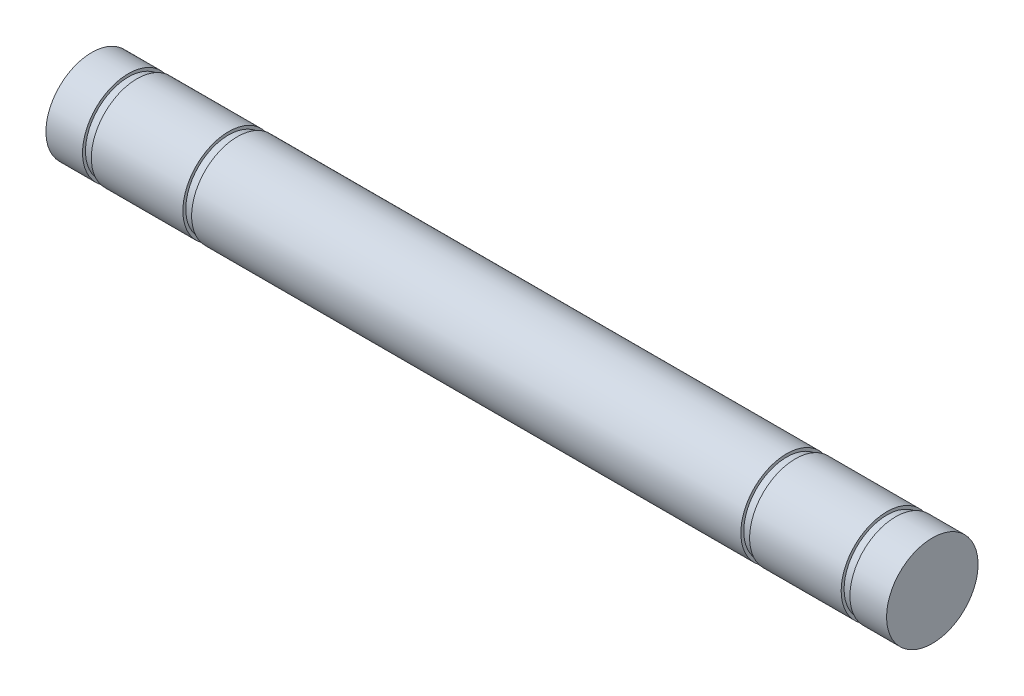
ISO-10303-21;
HEADER;
FILE_DESCRIPTION(('STEP AP214'),'2;1');
FILE_NAME('part.step','',(''),(''),'','','');
FILE_SCHEMA(('AUTOMOTIVE_DESIGN { 1 0 10303 214 1 1 1 1 }'));
ENDSEC;
DATA;
#1=APPLICATION_CONTEXT('core data for automotive mechanical design processes');
#2=APPLICATION_PROTOCOL_DEFINITION('international standard','automotive_design',2000,#1);
#3=PRODUCT_CONTEXT('',#1,'mechanical');
#4=PRODUCT('Part','Part','',(#3));
#5=PRODUCT_RELATED_PRODUCT_CATEGORY('part','',(#4));
#6=PRODUCT_DEFINITION_FORMATION('','',#4);
#7=PRODUCT_DEFINITION_CONTEXT('part definition',#1,'design');
#8=PRODUCT_DEFINITION('design','',#6,#7);
#9=PRODUCT_DEFINITION_SHAPE('','',#8);
#10=(LENGTH_UNIT() NAMED_UNIT(*) SI_UNIT(.MILLI.,.METRE.));
#11=(NAMED_UNIT(*) PLANE_ANGLE_UNIT() SI_UNIT($,.RADIAN.));
#12=(NAMED_UNIT(*) SI_UNIT($,.STERADIAN.) SOLID_ANGLE_UNIT());
#13=UNCERTAINTY_MEASURE_WITH_UNIT(LENGTH_MEASURE(1.E-05),#10,'distance_accuracy_value','');
#14=(GEOMETRIC_REPRESENTATION_CONTEXT(3) GLOBAL_UNCERTAINTY_ASSIGNED_CONTEXT((#13)) GLOBAL_UNIT_ASSIGNED_CONTEXT((#10,
#11,#12)) REPRESENTATION_CONTEXT('',''));
#15=CARTESIAN_POINT('',(0.,0.,0.));
#16=DIRECTION('',(0.,0.,1.));
#17=DIRECTION('',(1.,0.,0.));
#18=AXIS2_PLACEMENT_3D('',#15,#16,#17);
#19=CARTESIAN_POINT('',(-25.4,0.,0.));
#20=DIRECTION('',(1.,0.,0.));
#21=DIRECTION('',(0.,0.,-0.999999999999998));
#22=AXIS2_PLACEMENT_3D('',#19,#20,#21);
#23=CYLINDRICAL_SURFACE('',#22,1.5875);
#24=CARTESIAN_POINT('',(22.5298,0.,0.));
#25=DIRECTION('',(-1.,0.,0.));
#26=DIRECTION('',(0.,0.,0.999999999999998));
#27=AXIS2_PLACEMENT_3D('',#24,#25,#26);
#28=CIRCLE('',#27,1.5875);
#29=CARTESIAN_POINT('',(22.5298,0.,1.58749999999997));
#30=VERTEX_POINT('',#29);
#31=EDGE_CURVE('E65',#30,#30,#28,.F.);
#32=ORIENTED_EDGE('',*,*,#31,.F.);
#33=EDGE_LOOP('',(#32));
#34=FACE_BOUND('',#33,.T.);
#35=CARTESIAN_POINT('',(19.3548,0.,0.));
#36=DIRECTION('',(1.,0.,0.));
#37=DIRECTION('',(0.,0.,-0.999999999999998));
#38=AXIS2_PLACEMENT_3D('',#35,#36,#37);
#39=CIRCLE('',#38,1.5875);
#40=CARTESIAN_POINT('',(19.3548,0.,-1.58750000000001));
#41=VERTEX_POINT('',#40);
#42=EDGE_CURVE('E46',#41,#41,#39,.F.);
#43=ORIENTED_EDGE('',*,*,#42,.F.);
#44=EDGE_LOOP('',(#43));
#45=FACE_BOUND('',#44,.T.);
#46=ADVANCED_FACE('F36',(#34,#45),#23,.T.);
#47=CARTESIAN_POINT('',(19.3548,0.,0.));
#48=DIRECTION('',(1.,0.,0.));
#49=DIRECTION('',(0.,0.,-0.999999999999998));
#50=AXIS2_PLACEMENT_3D('',#47,#48,#49);
#51=PLANE('',#50);
#52=ORIENTED_EDGE('',*,*,#42,.T.);
#53=EDGE_LOOP('',(#52));
#54=FACE_BOUND('',#53,.T.);
#55=CARTESIAN_POINT('',(19.3548,0.,0.));
#56=DIRECTION('',(1.,0.,0.));
#57=DIRECTION('',(0.,0.,-0.999999999999998));
#58=AXIS2_PLACEMENT_3D('',#55,#56,#57);
#59=CIRCLE('',#58,1.4859);
#60=CARTESIAN_POINT('',(19.3548,0.,-1.48590000000001));
#61=VERTEX_POINT('',#60);
#62=EDGE_CURVE('E79',#61,#61,#59,.T.);
#63=ORIENTED_EDGE('',*,*,#62,.T.);
#64=EDGE_LOOP('',(#63));
#65=FACE_BOUND('',#64,.T.);
#66=ADVANCED_FACE('F120',(#54,#65),#51,.F.);
#67=CARTESIAN_POINT('',(19.05,0.,0.));
#68=DIRECTION('',(1.,0.,0.));
#69=DIRECTION('',(0.,0.,-0.999999999999998));
#70=AXIS2_PLACEMENT_3D('',#67,#68,#69);
#71=PLANE('',#70);
#72=CARTESIAN_POINT('',(19.05,0.,0.));
#73=DIRECTION('',(1.,0.,0.));
#74=DIRECTION('',(0.,0.,-0.999999999999998));
#75=AXIS2_PLACEMENT_3D('',#72,#73,#74);
#76=CIRCLE('',#75,1.5875);
#77=CARTESIAN_POINT('',(19.05,0.,-1.58750000000001));
#78=VERTEX_POINT('',#77);
#79=EDGE_CURVE('E50',#78,#78,#76,.F.);
#80=ORIENTED_EDGE('',*,*,#79,.F.);
#81=EDGE_LOOP('',(#80));
#82=FACE_BOUND('',#81,.T.);
#83=CARTESIAN_POINT('',(19.05,0.,0.));
#84=DIRECTION('',(1.,0.,0.));
#85=DIRECTION('',(0.,0.,-0.999999999999998));
#86=AXIS2_PLACEMENT_3D('',#83,#84,#85);
#87=CIRCLE('',#86,1.4859);
#88=CARTESIAN_POINT('',(19.05,0.,-1.48590000000001));
#89=VERTEX_POINT('',#88);
#90=EDGE_CURVE('E72',#89,#89,#87,.T.);
#91=ORIENTED_EDGE('',*,*,#90,.F.);
#92=EDGE_LOOP('',(#91));
#93=FACE_BOUND('',#92,.T.);
#94=ADVANCED_FACE('F126',(#82,#93),#71,.T.);
#95=CARTESIAN_POINT('',(19.3548,0.,0.));
#96=DIRECTION('',(-1.,0.,0.));
#97=DIRECTION('',(0.,0.,0.999999999999998));
#98=AXIS2_PLACEMENT_3D('',#95,#96,#97);
#99=CYLINDRICAL_SURFACE('',#98,1.4859);
#100=ORIENTED_EDGE('',*,*,#62,.F.);
#101=EDGE_LOOP('',(#100));
#102=FACE_BOUND('',#101,.T.);
#103=ORIENTED_EDGE('',*,*,#90,.T.);
#104=EDGE_LOOP('',(#103));
#105=FACE_BOUND('',#104,.T.);
#106=ADVANCED_FACE('F136',(#102,#105),#99,.T.);
#107=CARTESIAN_POINT('',(0.,0.,0.));
#108=DIRECTION('',(1.,0.,0.));
#109=DIRECTION('',(0.,0.,-0.999999999999998));
#110=AXIS2_PLACEMENT_3D('',#107,#108,#109);
#111=CIRCLE('',#110,1.5875);
#112=CARTESIAN_POINT('',(0.,0.,-1.5875));
#113=VERTEX_POINT('',#112);
#114=EDGE_CURVE('E73',#113,#113,#111,.F.);
#115=ORIENTED_EDGE('',*,*,#114,.F.);
#116=EDGE_LOOP('',(#115));
#117=FACE_BOUND('',#116,.T.);
#118=ORIENTED_EDGE('',*,*,#79,.T.);
#119=EDGE_LOOP('',(#118));
#120=FACE_BOUND('',#119,.T.);
#121=ADVANCED_FACE('F122',(#117,#120),#23,.T.);
#122=CARTESIAN_POINT('',(-0.304800000000022,0.,0.));
#123=DIRECTION('',(1.,0.,0.));
#124=DIRECTION('',(0.,0.,-0.999999999999998));
#125=AXIS2_PLACEMENT_3D('',#122,#123,#124);
#126=PLANE('',#125);
#127=CARTESIAN_POINT('',(-0.304800000000022,0.,0.));
#128=DIRECTION('',(1.,0.,0.));
#129=DIRECTION('',(0.,0.,-0.999999999999998));
#130=AXIS2_PLACEMENT_3D('',#127,#128,#129);
#131=CIRCLE('',#130,1.5875);
#132=CARTESIAN_POINT('',(-0.304800000000022,0.,-1.5875));
#133=VERTEX_POINT('',#132);
#134=EDGE_CURVE('E69',#133,#133,#131,.F.);
#135=ORIENTED_EDGE('',*,*,#134,.F.);
#136=EDGE_LOOP('',(#135));
#137=FACE_BOUND('',#136,.T.);
#138=CARTESIAN_POINT('',(-0.304800000000022,0.,0.));
#139=DIRECTION('',(1.,0.,0.));
#140=DIRECTION('',(0.,0.,-0.999999999999998));
#141=AXIS2_PLACEMENT_3D('',#138,#139,#140);
#142=CIRCLE('',#141,1.4859);
#143=CARTESIAN_POINT('',(-0.304800000000022,0.,-1.4859));
#144=VERTEX_POINT('',#143);
#145=EDGE_CURVE('E75',#144,#144,#142,.T.);
#146=ORIENTED_EDGE('',*,*,#145,.F.);
#147=EDGE_LOOP('',(#146));
#148=FACE_BOUND('',#147,.T.);
#149=ADVANCED_FACE('F135',(#137,#148),#126,.T.);
#150=CARTESIAN_POINT('',(0.,0.,0.));
#151=DIRECTION('',(1.,0.,0.));
#152=DIRECTION('',(0.,0.,-0.999999999999998));
#153=AXIS2_PLACEMENT_3D('',#150,#151,#152);
#154=PLANE('',#153);
#155=ORIENTED_EDGE('',*,*,#114,.T.);
#156=EDGE_LOOP('',(#155));
#157=FACE_BOUND('',#156,.T.);
#158=CARTESIAN_POINT('',(0.,0.,0.));
#159=DIRECTION('',(1.,0.,0.));
#160=DIRECTION('',(0.,0.,-0.999999999999998));
#161=AXIS2_PLACEMENT_3D('',#158,#159,#160);
#162=CIRCLE('',#161,1.4859);
#163=CARTESIAN_POINT('',(0.,0.,-1.4859));
#164=VERTEX_POINT('',#163);
#165=EDGE_CURVE('E64',#164,#164,#162,.T.);
#166=ORIENTED_EDGE('',*,*,#165,.T.);
#167=EDGE_LOOP('',(#166));
#168=FACE_BOUND('',#167,.T.);
#169=ADVANCED_FACE('F142',(#157,#168),#154,.F.);
#170=CARTESIAN_POINT('',(-0.304800000000022,0.,0.));
#171=DIRECTION('',(1.,0.,0.));
#172=DIRECTION('',(0.,0.,-0.999999999999998));
#173=AXIS2_PLACEMENT_3D('',#170,#171,#172);
#174=CYLINDRICAL_SURFACE('',#173,1.4859);
#175=ORIENTED_EDGE('',*,*,#145,.T.);
#176=EDGE_LOOP('',(#175));
#177=FACE_BOUND('',#176,.T.);
#178=ORIENTED_EDGE('',*,*,#165,.F.);
#179=EDGE_LOOP('',(#178));
#180=FACE_BOUND('',#179,.T.);
#181=ADVANCED_FACE('F151',(#177,#180),#174,.T.);
#182=CARTESIAN_POINT('',(-3.47979999999999,0.,0.));
#183=DIRECTION('',(1.,0.,0.));
#184=DIRECTION('',(0.,0.,-0.999999999999998));
#185=AXIS2_PLACEMENT_3D('',#182,#183,#184);
#186=CIRCLE('',#185,1.5875);
#187=CARTESIAN_POINT('',(-3.47979999999999,0.,-1.5875));
#188=VERTEX_POINT('',#187);
#189=EDGE_CURVE('E57',#188,#188,#186,.F.);
#190=ORIENTED_EDGE('',*,*,#189,.F.);
#191=EDGE_LOOP('',(#190));
#192=FACE_BOUND('',#191,.T.);
#193=ORIENTED_EDGE('',*,*,#134,.T.);
#194=EDGE_LOOP('',(#193));
#195=FACE_BOUND('',#194,.T.);
#196=ADVANCED_FACE('F115',(#192,#195),#23,.T.);
#197=CARTESIAN_POINT('',(22.8346,0.,0.));
#198=DIRECTION('',(-1.,0.,0.));
#199=DIRECTION('',(0.,0.,0.999999999999998));
#200=AXIS2_PLACEMENT_3D('',#197,#198,#199);
#201=PLANE('',#200);
#202=CARTESIAN_POINT('',(22.8346,0.,0.));
#203=DIRECTION('',(-1.,0.,0.));
#204=DIRECTION('',(0.,0.,0.999999999999998));
#205=AXIS2_PLACEMENT_3D('',#202,#203,#204);
#206=CIRCLE('',#205,1.5875);
#207=CARTESIAN_POINT('',(22.8346,0.,1.58749999999998));
#208=VERTEX_POINT('',#207);
#209=EDGE_CURVE('E61',#208,#208,#206,.F.);
#210=ORIENTED_EDGE('',*,*,#209,.F.);
#211=EDGE_LOOP('',(#210));
#212=FACE_BOUND('',#211,.T.);
#213=CARTESIAN_POINT('',(22.8346,0.,0.));
#214=DIRECTION('',(-1.,0.,0.));
#215=DIRECTION('',(0.,0.,0.999999999999998));
#216=AXIS2_PLACEMENT_3D('',#213,#214,#215);
#217=CIRCLE('',#216,1.4859);
#218=CARTESIAN_POINT('',(22.8346,0.,1.48589999999998));
#219=VERTEX_POINT('',#218);
#220=EDGE_CURVE('E68',#219,#219,#217,.T.);
#221=ORIENTED_EDGE('',*,*,#220,.F.);
#222=EDGE_LOOP('',(#221));
#223=FACE_BOUND('',#222,.T.);
#224=ADVANCED_FACE('F150',(#212,#223),#201,.T.);
#225=CARTESIAN_POINT('',(22.5298,0.,0.));
#226=DIRECTION('',(-1.,0.,0.));
#227=DIRECTION('',(0.,0.,0.999999999999998));
#228=AXIS2_PLACEMENT_3D('',#225,#226,#227);
#229=PLANE('',#228);
#230=ORIENTED_EDGE('',*,*,#31,.T.);
#231=EDGE_LOOP('',(#230));
#232=FACE_BOUND('',#231,.T.);
#233=CARTESIAN_POINT('',(22.5298,0.,0.));
#234=DIRECTION('',(-1.,0.,0.));
#235=DIRECTION('',(0.,0.,0.999999999999998));
#236=AXIS2_PLACEMENT_3D('',#233,#234,#235);
#237=CIRCLE('',#236,1.4859);
#238=CARTESIAN_POINT('',(22.5298,0.,1.48589999999997));
#239=VERTEX_POINT('',#238);
#240=EDGE_CURVE('E56',#239,#239,#237,.T.);
#241=ORIENTED_EDGE('',*,*,#240,.T.);
#242=EDGE_LOOP('',(#241));
#243=FACE_BOUND('',#242,.T.);
#244=ADVANCED_FACE('F157',(#232,#243),#229,.F.);
#245=CARTESIAN_POINT('',(22.8346,0.,0.));
#246=DIRECTION('',(-1.,0.,0.));
#247=DIRECTION('',(0.,0.,0.999999999999998));
#248=AXIS2_PLACEMENT_3D('',#245,#246,#247);
#249=CYLINDRICAL_SURFACE('',#248,1.4859);
#250=ORIENTED_EDGE('',*,*,#220,.T.);
#251=EDGE_LOOP('',(#250));
#252=FACE_BOUND('',#251,.T.);
#253=ORIENTED_EDGE('',*,*,#240,.F.);
#254=EDGE_LOOP('',(#253));
#255=FACE_BOUND('',#254,.T.);
#256=ADVANCED_FACE('F113',(#252,#255),#249,.T.);
#257=CARTESIAN_POINT('',(24.1046,0.,0.));
#258=DIRECTION('',(-1.,0.,0.));
#259=DIRECTION('',(0.,0.,0.999999999999998));
#260=AXIS2_PLACEMENT_3D('',#257,#258,#259);
#261=CIRCLE('',#260,1.5875);
#262=CARTESIAN_POINT('',(24.1046,0.,1.58749999999996));
#263=VERTEX_POINT('',#262);
#264=EDGE_CURVE('E11',#263,#263,#261,.F.);
#265=ORIENTED_EDGE('',*,*,#264,.F.);
#266=EDGE_LOOP('',(#265));
#267=FACE_BOUND('',#266,.T.);
#268=ORIENTED_EDGE('',*,*,#209,.T.);
#269=EDGE_LOOP('',(#268));
#270=FACE_BOUND('',#269,.T.);
#271=ADVANCED_FACE('F104',(#267,#270),#23,.T.);
#272=CARTESIAN_POINT('',(-3.7846,0.,0.));
#273=DIRECTION('',(1.,0.,0.));
#274=DIRECTION('',(0.,0.,-0.999999999999998));
#275=AXIS2_PLACEMENT_3D('',#272,#273,#274);
#276=PLANE('',#275);
#277=CARTESIAN_POINT('',(-3.7846,0.,0.));
#278=DIRECTION('',(1.,0.,0.));
#279=DIRECTION('',(0.,0.,-0.999999999999998));
#280=AXIS2_PLACEMENT_3D('',#277,#278,#279);
#281=CIRCLE('',#280,1.5875);
#282=CARTESIAN_POINT('',(-3.7846,0.,-1.58750000000002));
#283=VERTEX_POINT('',#282);
#284=EDGE_CURVE('E53',#283,#283,#281,.F.);
#285=ORIENTED_EDGE('',*,*,#284,.F.);
#286=EDGE_LOOP('',(#285));
#287=FACE_BOUND('',#286,.T.);
#288=CARTESIAN_POINT('',(-3.7846,0.,0.));
#289=DIRECTION('',(1.,0.,0.));
#290=DIRECTION('',(0.,0.,-0.999999999999998));
#291=AXIS2_PLACEMENT_3D('',#288,#289,#290);
#292=CIRCLE('',#291,1.4859);
#293=CARTESIAN_POINT('',(-3.7846,0.,-1.48590000000002));
#294=VERTEX_POINT('',#293);
#295=EDGE_CURVE('E60',#294,#294,#292,.T.);
#296=ORIENTED_EDGE('',*,*,#295,.F.);
#297=EDGE_LOOP('',(#296));
#298=FACE_BOUND('',#297,.T.);
#299=ADVANCED_FACE('F101',(#287,#298),#276,.T.);
#300=CARTESIAN_POINT('',(-3.47979999999999,0.,0.));
#301=DIRECTION('',(1.,0.,0.));
#302=DIRECTION('',(0.,0.,-0.999999999999998));
#303=AXIS2_PLACEMENT_3D('',#300,#301,#302);
#304=PLANE('',#303);
#305=ORIENTED_EDGE('',*,*,#189,.T.);
#306=EDGE_LOOP('',(#305));
#307=FACE_BOUND('',#306,.T.);
#308=CARTESIAN_POINT('',(-3.47979999999999,0.,0.));
#309=DIRECTION('',(1.,0.,0.));
#310=DIRECTION('',(0.,0.,-0.999999999999998));
#311=AXIS2_PLACEMENT_3D('',#308,#309,#310);
#312=CIRCLE('',#311,1.4859);
#313=CARTESIAN_POINT('',(-3.47979999999999,0.,-1.4859));
#314=VERTEX_POINT('',#313);
#315=EDGE_CURVE('E92',#314,#314,#312,.T.);
#316=ORIENTED_EDGE('',*,*,#315,.T.);
#317=EDGE_LOOP('',(#316));
#318=FACE_BOUND('',#317,.T.);
#319=ADVANCED_FACE('F103',(#307,#318),#304,.F.);
#320=CARTESIAN_POINT('',(-3.7846,0.,0.));
#321=DIRECTION('',(1.,0.,0.));
#322=DIRECTION('',(0.,0.,-0.999999999999998));
#323=AXIS2_PLACEMENT_3D('',#320,#321,#322);
#324=CYLINDRICAL_SURFACE('',#323,1.4859);
#325=ORIENTED_EDGE('',*,*,#295,.T.);
#326=EDGE_LOOP('',(#325));
#327=FACE_BOUND('',#326,.T.);
#328=ORIENTED_EDGE('',*,*,#315,.F.);
#329=EDGE_LOOP('',(#328));
#330=FACE_BOUND('',#329,.T.);
#331=ADVANCED_FACE('F98',(#327,#330),#324,.T.);
#332=CARTESIAN_POINT('',(-5.05460000000001,0.,0.));
#333=DIRECTION('',(1.,0.,0.));
#334=DIRECTION('',(0.,0.,-0.999999999999998));
#335=AXIS2_PLACEMENT_3D('',#332,#333,#334);
#336=CIRCLE('',#335,1.5875);
#337=CARTESIAN_POINT('',(-5.05460000000001,0.,-1.58749999999998));
#338=VERTEX_POINT('',#337);
#339=EDGE_CURVE('E42',#338,#338,#336,.F.);
#340=ORIENTED_EDGE('',*,*,#339,.F.);
#341=EDGE_LOOP('',(#340));
#342=FACE_BOUND('',#341,.T.);
#343=ORIENTED_EDGE('',*,*,#284,.T.);
#344=EDGE_LOOP('',(#343));
#345=FACE_BOUND('',#344,.T.);
#346=ADVANCED_FACE('F116',(#342,#345),#23,.T.);
#347=CARTESIAN_POINT('',(-5.05459999999998,3.175,-1.5875));
#348=DIRECTION('',(1.,0.,0.));
#349=DIRECTION('',(0.,0.,-0.999999999999998));
#350=AXIS2_PLACEMENT_3D('',#347,#348,#349);
#351=PLANE('',#350);
#352=ORIENTED_EDGE('',*,*,#339,.T.);
#353=EDGE_LOOP('',(#352));
#354=FACE_BOUND('',#353,.T.);
#355=ADVANCED_FACE('F132',(#354),#351,.F.);
#356=CARTESIAN_POINT('',(24.1046,3.17499999999997,-1.5875));
#357=DIRECTION('',(-1.,0.,0.));
#358=DIRECTION('',(0.,0.,0.999999999999998));
#359=AXIS2_PLACEMENT_3D('',#356,#357,#358);
#360=PLANE('',#359);
#361=ORIENTED_EDGE('',*,*,#264,.T.);
#362=EDGE_LOOP('',(#361));
#363=FACE_BOUND('',#362,.T.);
#364=ADVANCED_FACE('F277',(#363),#360,.F.);
#365=CLOSED_SHELL('',(#46,#66,#94,#106,#121,#149,#169,#181,#196,#224,#244,#256,#271,#299,#319,
#331,#346,#355,#364));
#366=MANIFOLD_SOLID_BREP('B2',#365);
#367=ADVANCED_BREP_SHAPE_REPRESENTATION('',(#18,#366),#14);
#368=SHAPE_DEFINITION_REPRESENTATION(#9,#367);
ENDSEC;
END-ISO-10303-21;
